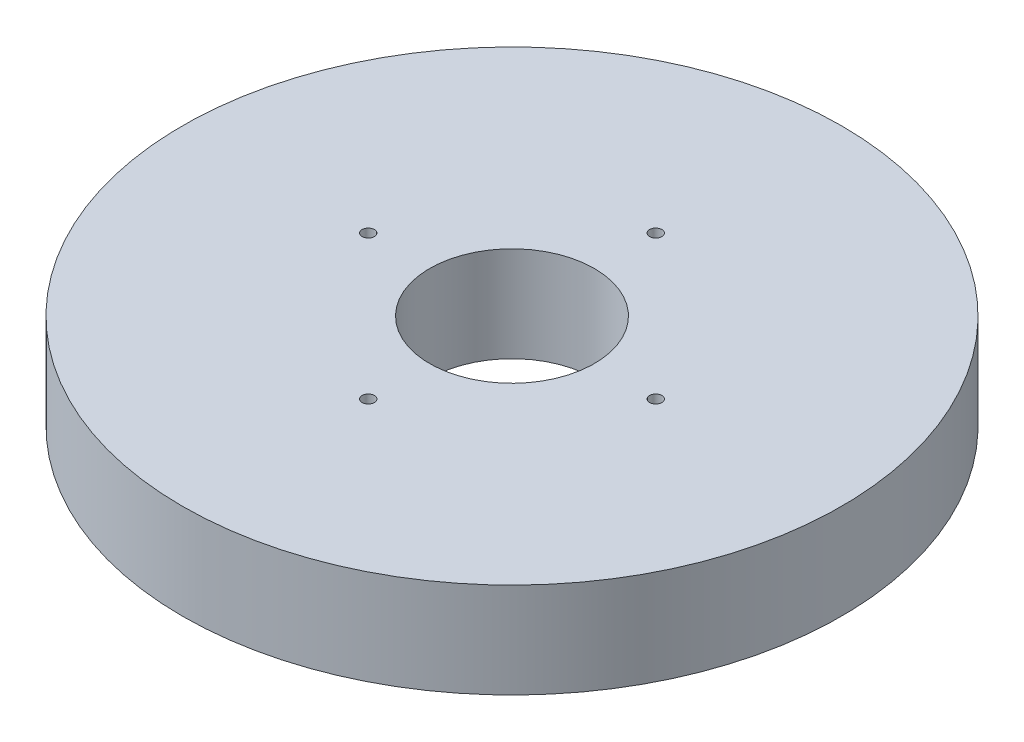
ISO-10303-21;
HEADER;
FILE_DESCRIPTION(('STEP AP214'),'2;1');
FILE_NAME('part.step','',(''),(''),'','','');
FILE_SCHEMA(('AUTOMOTIVE_DESIGN { 1 0 10303 214 1 1 1 1 }'));
ENDSEC;
DATA;
#1=APPLICATION_CONTEXT('core data for automotive mechanical design processes');
#2=APPLICATION_PROTOCOL_DEFINITION('international standard','automotive_design',2000,#1);
#3=PRODUCT_CONTEXT('',#1,'mechanical');
#4=PRODUCT('Part','Part','',(#3));
#5=PRODUCT_RELATED_PRODUCT_CATEGORY('part','',(#4));
#6=PRODUCT_DEFINITION_FORMATION('','',#4);
#7=PRODUCT_DEFINITION_CONTEXT('part definition',#1,'design');
#8=PRODUCT_DEFINITION('design','',#6,#7);
#9=PRODUCT_DEFINITION_SHAPE('','',#8);
#10=(LENGTH_UNIT() NAMED_UNIT(*) SI_UNIT(.MILLI.,.METRE.));
#11=(NAMED_UNIT(*) PLANE_ANGLE_UNIT() SI_UNIT($,.RADIAN.));
#12=(NAMED_UNIT(*) SI_UNIT($,.STERADIAN.) SOLID_ANGLE_UNIT());
#13=UNCERTAINTY_MEASURE_WITH_UNIT(LENGTH_MEASURE(1.E-05),#10,'distance_accuracy_value','');
#14=(GEOMETRIC_REPRESENTATION_CONTEXT(3) GLOBAL_UNCERTAINTY_ASSIGNED_CONTEXT((#13)) GLOBAL_UNIT_ASSIGNED_CONTEXT((#10,
#11,#12)) REPRESENTATION_CONTEXT('',''));
#15=CARTESIAN_POINT('',(0.,0.,0.));
#16=DIRECTION('',(0.,0.,1.));
#17=DIRECTION('',(1.,0.,0.));
#18=AXIS2_PLACEMENT_3D('',#15,#16,#17);
#19=CARTESIAN_POINT('',(0.,26.,0.));
#20=DIRECTION('',(0.,-1.,0.));
#21=DIRECTION('',(0.,0.,-1.));
#22=AXIS2_PLACEMENT_3D('',#19,#20,#21);
#23=CYLINDRICAL_SURFACE('',#22,90.);
#24=CARTESIAN_POINT('',(0.,26.,0.));
#25=DIRECTION('',(0.,1.,0.));
#26=DIRECTION('',(0.,0.,1.));
#27=AXIS2_PLACEMENT_3D('',#24,#25,#26);
#28=CIRCLE('',#27,90.);
#29=CARTESIAN_POINT('',(0.,26.,-90.));
#30=VERTEX_POINT('',#29);
#31=EDGE_CURVE('E10',#30,#30,#28,.T.);
#32=CARTESIAN_POINT('',(0.,0.,0.));
#33=DIRECTION('',(0.,1.,0.));
#34=DIRECTION('',(0.,0.,1.));
#35=AXIS2_PLACEMENT_3D('',#32,#33,#34);
#36=CIRCLE('',#35,90.);
#37=CARTESIAN_POINT('',(0.,0.,-90.));
#38=VERTEX_POINT('',#37);
#39=EDGE_CURVE('E37',#38,#38,#36,.T.);
#40=CARTESIAN_POINT('',(0.,26.,-90.));
#41=CARTESIAN_POINT('',(0.,25.7291666666667,-90.));
#42=CARTESIAN_POINT('',(0.,25.4583333333333,-90.));
#43=CARTESIAN_POINT('',(0.,24.9166666666667,-90.));
#44=CARTESIAN_POINT('',(0.,24.6458333333333,-90.));
#45=CARTESIAN_POINT('',(0.,24.1041666666667,-90.));
#46=CARTESIAN_POINT('',(0.,23.8333333333333,-90.));
#47=CARTESIAN_POINT('',(0.,23.2916666666667,-90.));
#48=CARTESIAN_POINT('',(0.,23.0208333333333,-90.));
#49=CARTESIAN_POINT('',(0.,22.4791666666667,-90.));
#50=CARTESIAN_POINT('',(0.,22.2083333333333,-90.));
#51=CARTESIAN_POINT('',(0.,21.6666666666667,-90.));
#52=CARTESIAN_POINT('',(0.,21.3958333333333,-90.));
#53=CARTESIAN_POINT('',(0.,20.8541666666667,-90.));
#54=CARTESIAN_POINT('',(0.,20.5833333333333,-90.));
#55=CARTESIAN_POINT('',(0.,20.0416666666667,-90.));
#56=CARTESIAN_POINT('',(0.,19.7708333333333,-90.));
#57=CARTESIAN_POINT('',(0.,19.2291666666667,-90.));
#58=CARTESIAN_POINT('',(0.,18.9583333333333,-90.));
#59=CARTESIAN_POINT('',(0.,18.4166666666667,-90.));
#60=CARTESIAN_POINT('',(0.,18.1458333333333,-90.));
#61=CARTESIAN_POINT('',(0.,17.6041666666667,-90.));
#62=CARTESIAN_POINT('',(0.,17.3333333333333,-90.));
#63=CARTESIAN_POINT('',(0.,16.7916666666667,-90.));
#64=CARTESIAN_POINT('',(0.,16.5208333333333,-90.));
#65=CARTESIAN_POINT('',(0.,15.9791666666667,-90.));
#66=CARTESIAN_POINT('',(0.,15.7083333333333,-90.));
#67=CARTESIAN_POINT('',(0.,15.1666666666667,-90.));
#68=CARTESIAN_POINT('',(0.,14.8958333333333,-90.));
#69=CARTESIAN_POINT('',(0.,14.3541666666667,-90.));
#70=CARTESIAN_POINT('',(0.,14.0833333333333,-90.));
#71=CARTESIAN_POINT('',(0.,13.5416666666667,-90.));
#72=CARTESIAN_POINT('',(0.,13.2708333333333,-90.));
#73=CARTESIAN_POINT('',(0.,12.7291666666667,-90.));
#74=CARTESIAN_POINT('',(0.,12.4583333333333,-90.));
#75=CARTESIAN_POINT('',(0.,11.9166666666667,-90.));
#76=CARTESIAN_POINT('',(0.,11.6458333333333,-90.));
#77=CARTESIAN_POINT('',(0.,11.1041666666667,-90.));
#78=CARTESIAN_POINT('',(0.,10.8333333333333,-90.));
#79=CARTESIAN_POINT('',(0.,10.2916666666667,-90.));
#80=CARTESIAN_POINT('',(0.,10.0208333333333,-90.));
#81=CARTESIAN_POINT('',(0.,9.47916666666667,-90.));
#82=CARTESIAN_POINT('',(0.,9.20833333333333,-90.));
#83=CARTESIAN_POINT('',(0.,8.66666666666667,-90.));
#84=CARTESIAN_POINT('',(0.,8.39583333333333,-90.));
#85=CARTESIAN_POINT('',(0.,7.85416666666667,-90.));
#86=CARTESIAN_POINT('',(0.,7.58333333333333,-90.));
#87=CARTESIAN_POINT('',(0.,7.04166666666667,-90.));
#88=CARTESIAN_POINT('',(0.,6.77083333333333,-90.));
#89=CARTESIAN_POINT('',(0.,6.22916666666667,-90.));
#90=CARTESIAN_POINT('',(0.,5.95833333333333,-90.));
#91=CARTESIAN_POINT('',(0.,5.41666666666667,-90.));
#92=CARTESIAN_POINT('',(0.,5.14583333333333,-90.));
#93=CARTESIAN_POINT('',(0.,4.60416666666667,-90.));
#94=CARTESIAN_POINT('',(0.,4.33333333333333,-90.));
#95=CARTESIAN_POINT('',(0.,3.79166666666667,-90.));
#96=CARTESIAN_POINT('',(0.,3.52083333333333,-90.));
#97=CARTESIAN_POINT('',(0.,2.97916666666667,-90.));
#98=CARTESIAN_POINT('',(0.,2.70833333333333,-90.));
#99=CARTESIAN_POINT('',(0.,2.16666666666667,-90.));
#100=CARTESIAN_POINT('',(0.,1.89583333333333,-90.));
#101=CARTESIAN_POINT('',(0.,1.35416666666667,-90.));
#102=CARTESIAN_POINT('',(0.,1.08333333333333,-90.));
#103=CARTESIAN_POINT('',(0.,0.541666666666667,-90.));
#104=CARTESIAN_POINT('',(0.,0.270833333333334,-90.));
#105=CARTESIAN_POINT('',(0.,0.,-90.));
#106=B_SPLINE_CURVE_WITH_KNOTS('',3,(#40,#41,#42,#43,#44,#45,#46,#47,#48,#49,#50,#51,#52,#53,
#54,#55,#56,#57,#58,#59,#60,#61,#62,#63,#64,#65,#66,#67,#68,#69,#70,#71,#72,#73,#74,#75,#76,#77,
#78,#79,#80,#81,#82,#83,#84,#85,#86,#87,#88,#89,#90,#91,#92,#93,#94,#95,#96,#97,#98,#99,#100,
#101,#102,#103,#104,#105),.UNSPECIFIED.,.F.,.F.,(4,2,2,2,2,2,2,2,2,2,2,2,2,2,2,2,2,2,2,2,2,2,2,
2,2,2,2,2,2,2,2,2,4),(0.,0.812500000000001,1.625,2.4375,3.25,4.0625,4.875,5.6875,6.5,7.3125,
8.125,8.9375,9.75,10.5625,11.375,12.1875,13.,13.8125,14.625,15.4375,16.25,17.0625,17.875,
18.6875,19.5,20.3125,21.125,21.9375,22.75,23.5625,24.375,25.1875,26.),.UNSPECIFIED.);
#107=EDGE_CURVE('BSEAM40',#30,#38,#106,.T.);
#108=ORIENTED_EDGE('',*,*,#31,.F.);
#109=ORIENTED_EDGE('',*,*,#39,.T.);
#110=ORIENTED_EDGE('',*,*,#107,.T.);
#111=ORIENTED_EDGE('',*,*,#107,.F.);
#112=EDGE_LOOP('',(#108,#110,#109,#111));
#113=FACE_BOUND('',#112,.T.);
#114=ADVANCED_FACE('F40',(#113),#23,.T.);
#115=CARTESIAN_POINT('',(0.,26.,0.));
#116=DIRECTION('',(0.,1.,0.));
#117=DIRECTION('',(0.,0.,1.));
#118=AXIS2_PLACEMENT_3D('',#115,#116,#117);
#119=PLANE('',#118);
#120=CARTESIAN_POINT('',(1.37045153029489E-13,26.,39.2512918527863));
#121=DIRECTION('',(0.,1.,0.));
#122=DIRECTION('',(1.,0.,0.));
#123=AXIS2_PLACEMENT_3D('',#120,#121,#122);
#124=CIRCLE('',#123,1.67783377994379);
#125=CARTESIAN_POINT('',(1.67783377994393,26.,39.2512918527863));
#126=VERTEX_POINT('',#125);
#127=EDGE_CURVE('E71',#126,#126,#124,.T.);
#128=ORIENTED_EDGE('',*,*,#127,.F.);
#129=EDGE_LOOP('',(#128));
#130=FACE_BOUND('',#129,.T.);
#131=CARTESIAN_POINT('',(39.2512918527863,26.,0.));
#132=DIRECTION('',(0.,1.,0.));
#133=DIRECTION('',(0.,0.,-1.));
#134=AXIS2_PLACEMENT_3D('',#131,#132,#133);
#135=CIRCLE('',#134,1.67783377994379);
#136=CARTESIAN_POINT('',(39.2512918527863,26.,-1.67783377994379));
#137=VERTEX_POINT('',#136);
#138=EDGE_CURVE('E70',#137,#137,#135,.T.);
#139=ORIENTED_EDGE('',*,*,#138,.F.);
#140=EDGE_LOOP('',(#139));
#141=FACE_BOUND('',#140,.T.);
#142=CARTESIAN_POINT('',(-4.11135459088467E-13,26.,-39.2512918527863));
#143=DIRECTION('',(0.,1.,0.));
#144=DIRECTION('',(-1.,0.,0.));
#145=AXIS2_PLACEMENT_3D('',#142,#143,#144);
#146=CIRCLE('',#145,1.67783377994379);
#147=CARTESIAN_POINT('',(-1.6778337799442,26.,-39.2512918527863));
#148=VERTEX_POINT('',#147);
#149=EDGE_CURVE('E61',#148,#148,#146,.T.);
#150=ORIENTED_EDGE('',*,*,#149,.F.);
#151=EDGE_LOOP('',(#150));
#152=FACE_BOUND('',#151,.T.);
#153=CARTESIAN_POINT('',(-39.2512918527863,26.,0.));
#154=DIRECTION('',(0.,1.,0.));
#155=DIRECTION('',(0.,0.,1.));
#156=AXIS2_PLACEMENT_3D('',#153,#154,#155);
#157=CIRCLE('',#156,1.67783377994379);
#158=CARTESIAN_POINT('',(-39.2512918527863,26.,1.67783377994379));
#159=VERTEX_POINT('',#158);
#160=EDGE_CURVE('E54',#159,#159,#157,.T.);
#161=ORIENTED_EDGE('',*,*,#160,.F.);
#162=EDGE_LOOP('',(#161));
#163=FACE_BOUND('',#162,.T.);
#164=CARTESIAN_POINT('',(0.,26.,0.));
#165=DIRECTION('',(0.,1.,0.));
#166=DIRECTION('',(0.,0.,1.));
#167=AXIS2_PLACEMENT_3D('',#164,#165,#166);
#168=CIRCLE('',#167,22.5);
#169=CARTESIAN_POINT('',(0.,26.,-22.5));
#170=VERTEX_POINT('',#169);
#171=EDGE_CURVE('E50',#170,#170,#168,.T.);
#172=ORIENTED_EDGE('',*,*,#171,.F.);
#173=EDGE_LOOP('',(#172));
#174=FACE_BOUND('',#173,.T.);
#175=ORIENTED_EDGE('',*,*,#31,.T.);
#176=EDGE_LOOP('',(#175));
#177=FACE_BOUND('',#176,.T.);
#178=ADVANCED_FACE('F86',(#130,#141,#152,#163,#174,#177),#119,.T.);
#179=CARTESIAN_POINT('',(0.,0.,0.));
#180=DIRECTION('',(0.,1.,0.));
#181=DIRECTION('',(0.,0.,1.));
#182=AXIS2_PLACEMENT_3D('',#179,#180,#181);
#183=PLANE('',#182);
#184=CARTESIAN_POINT('',(0.,0.,0.));
#185=DIRECTION('',(0.,1.,0.));
#186=DIRECTION('',(0.,0.,1.));
#187=AXIS2_PLACEMENT_3D('',#184,#185,#186);
#188=CIRCLE('',#187,22.5);
#189=CARTESIAN_POINT('',(0.,0.,-22.5));
#190=VERTEX_POINT('',#189);
#191=EDGE_CURVE('E47',#190,#190,#188,.T.);
#192=ORIENTED_EDGE('',*,*,#191,.T.);
#193=EDGE_LOOP('',(#192));
#194=FACE_BOUND('',#193,.T.);
#195=ORIENTED_EDGE('',*,*,#39,.F.);
#196=EDGE_LOOP('',(#195));
#197=FACE_BOUND('',#196,.T.);
#198=ADVANCED_FACE('F93',(#194,#197),#183,.F.);
#199=CARTESIAN_POINT('',(0.,26.,0.));
#200=DIRECTION('',(0.,-1.,0.));
#201=DIRECTION('',(0.,0.,-1.));
#202=AXIS2_PLACEMENT_3D('',#199,#200,#201);
#203=CYLINDRICAL_SURFACE('',#202,22.5);
#204=CARTESIAN_POINT('',(0.,26.,-22.5));
#205=CARTESIAN_POINT('',(0.,25.7291666666667,-22.5));
#206=CARTESIAN_POINT('',(0.,25.4583333333333,-22.5));
#207=CARTESIAN_POINT('',(0.,24.9166666666667,-22.5));
#208=CARTESIAN_POINT('',(0.,24.6458333333333,-22.5));
#209=CARTESIAN_POINT('',(0.,24.1041666666667,-22.5));
#210=CARTESIAN_POINT('',(0.,23.8333333333333,-22.5));
#211=CARTESIAN_POINT('',(0.,23.2916666666667,-22.5));
#212=CARTESIAN_POINT('',(0.,23.0208333333333,-22.5));
#213=CARTESIAN_POINT('',(0.,22.4791666666667,-22.5));
#214=CARTESIAN_POINT('',(0.,22.2083333333333,-22.5));
#215=CARTESIAN_POINT('',(0.,21.6666666666667,-22.5));
#216=CARTESIAN_POINT('',(0.,21.3958333333333,-22.5));
#217=CARTESIAN_POINT('',(0.,20.8541666666667,-22.5));
#218=CARTESIAN_POINT('',(0.,20.5833333333333,-22.5));
#219=CARTESIAN_POINT('',(0.,20.0416666666667,-22.5));
#220=CARTESIAN_POINT('',(0.,19.7708333333333,-22.5));
#221=CARTESIAN_POINT('',(0.,19.2291666666667,-22.5));
#222=CARTESIAN_POINT('',(0.,18.9583333333333,-22.5));
#223=CARTESIAN_POINT('',(0.,18.4166666666667,-22.5));
#224=CARTESIAN_POINT('',(0.,18.1458333333333,-22.5));
#225=CARTESIAN_POINT('',(0.,17.6041666666667,-22.5));
#226=CARTESIAN_POINT('',(0.,17.3333333333333,-22.5));
#227=CARTESIAN_POINT('',(0.,16.7916666666667,-22.5));
#228=CARTESIAN_POINT('',(0.,16.5208333333333,-22.5));
#229=CARTESIAN_POINT('',(0.,15.9791666666667,-22.5));
#230=CARTESIAN_POINT('',(0.,15.7083333333333,-22.5));
#231=CARTESIAN_POINT('',(0.,15.1666666666667,-22.5));
#232=CARTESIAN_POINT('',(0.,14.8958333333333,-22.5));
#233=CARTESIAN_POINT('',(0.,14.3541666666667,-22.5));
#234=CARTESIAN_POINT('',(0.,14.0833333333333,-22.5));
#235=CARTESIAN_POINT('',(0.,13.5416666666667,-22.5));
#236=CARTESIAN_POINT('',(0.,13.2708333333333,-22.5));
#237=CARTESIAN_POINT('',(0.,12.7291666666667,-22.5));
#238=CARTESIAN_POINT('',(0.,12.4583333333333,-22.5));
#239=CARTESIAN_POINT('',(0.,11.9166666666667,-22.5));
#240=CARTESIAN_POINT('',(0.,11.6458333333333,-22.5));
#241=CARTESIAN_POINT('',(0.,11.1041666666667,-22.5));
#242=CARTESIAN_POINT('',(0.,10.8333333333333,-22.5));
#243=CARTESIAN_POINT('',(0.,10.2916666666667,-22.5));
#244=CARTESIAN_POINT('',(0.,10.0208333333333,-22.5));
#245=CARTESIAN_POINT('',(0.,9.47916666666667,-22.5));
#246=CARTESIAN_POINT('',(0.,9.20833333333333,-22.5));
#247=CARTESIAN_POINT('',(0.,8.66666666666667,-22.5));
#248=CARTESIAN_POINT('',(0.,8.39583333333333,-22.5));
#249=CARTESIAN_POINT('',(0.,7.85416666666667,-22.5));
#250=CARTESIAN_POINT('',(0.,7.58333333333333,-22.5));
#251=CARTESIAN_POINT('',(0.,7.04166666666667,-22.5));
#252=CARTESIAN_POINT('',(0.,6.77083333333333,-22.5));
#253=CARTESIAN_POINT('',(0.,6.22916666666667,-22.5));
#254=CARTESIAN_POINT('',(0.,5.95833333333333,-22.5));
#255=CARTESIAN_POINT('',(0.,5.41666666666667,-22.5));
#256=CARTESIAN_POINT('',(0.,5.14583333333333,-22.5));
#257=CARTESIAN_POINT('',(0.,4.60416666666667,-22.5));
#258=CARTESIAN_POINT('',(0.,4.33333333333333,-22.5));
#259=CARTESIAN_POINT('',(0.,3.79166666666667,-22.5));
#260=CARTESIAN_POINT('',(0.,3.52083333333333,-22.5));
#261=CARTESIAN_POINT('',(0.,2.97916666666667,-22.5));
#262=CARTESIAN_POINT('',(0.,2.70833333333333,-22.5));
#263=CARTESIAN_POINT('',(0.,2.16666666666667,-22.5));
#264=CARTESIAN_POINT('',(0.,1.89583333333333,-22.5));
#265=CARTESIAN_POINT('',(0.,1.35416666666667,-22.5));
#266=CARTESIAN_POINT('',(0.,1.08333333333333,-22.5));
#267=CARTESIAN_POINT('',(0.,0.541666666666667,-22.5));
#268=CARTESIAN_POINT('',(0.,0.270833333333334,-22.5));
#269=CARTESIAN_POINT('',(0.,0.,-22.5));
#270=B_SPLINE_CURVE_WITH_KNOTS('',3,(#204,#205,#206,#207,#208,#209,#210,#211,#212,#213,#214,
#215,#216,#217,#218,#219,#220,#221,#222,#223,#224,#225,#226,#227,#228,#229,#230,#231,#232,#233,
#234,#235,#236,#237,#238,#239,#240,#241,#242,#243,#244,#245,#246,#247,#248,#249,#250,#251,#252,
#253,#254,#255,#256,#257,#258,#259,#260,#261,#262,#263,#264,#265,#266,#267,#268,#269),
.UNSPECIFIED.,.F.,.F.,(4,2,2,2,2,2,2,2,2,2,2,2,2,2,2,2,2,2,2,2,2,2,2,2,2,2,2,2,2,2,2,2,4),(0.,
0.812499999999997,1.625,2.4375,3.25,4.0625,4.875,5.6875,6.5,7.3125,8.125,8.93749999999999,
9.74999999999999,10.5625,11.375,12.1875,13.,13.8125,14.625,15.4375,16.25,17.0625,17.875,18.6875,
19.5,20.3125,21.125,21.9375,22.75,23.5625,24.375,25.1875,26.),.UNSPECIFIED.);
#271=EDGE_CURVE('BSEAM101',#170,#190,#270,.T.);
#272=ORIENTED_EDGE('',*,*,#171,.T.);
#273=ORIENTED_EDGE('',*,*,#191,.F.);
#274=ORIENTED_EDGE('',*,*,#271,.T.);
#275=ORIENTED_EDGE('',*,*,#271,.F.);
#276=EDGE_LOOP('',(#272,#274,#273,#275));
#277=FACE_BOUND('',#276,.T.);
#278=ADVANCED_FACE('F101',(#277),#203,.F.);
#279=CARTESIAN_POINT('',(-39.2512918527863,7.56450919576629,0.));
#280=DIRECTION('',(0.,1.,0.));
#281=DIRECTION('',(0.,0.,1.));
#282=AXIS2_PLACEMENT_3D('',#279,#280,#281);
#283=CYLINDRICAL_SURFACE('',#282,1.67783377994379);
#284=CARTESIAN_POINT('',(-39.2512918527863,7.56450919576629,0.));
#285=DIRECTION('',(0.,1.,0.));
#286=DIRECTION('',(0.,0.,1.));
#287=AXIS2_PLACEMENT_3D('',#284,#285,#286);
#288=CIRCLE('',#287,1.67783377994379);
#289=CARTESIAN_POINT('',(-39.2512918527863,7.56450919576629,1.67783377994379));
#290=VERTEX_POINT('',#289);
#291=EDGE_CURVE('E55',#290,#290,#288,.T.);
#292=ORIENTED_EDGE('',*,*,#291,.F.);
#293=EDGE_LOOP('',(#292));
#294=FACE_BOUND('',#293,.T.);
#295=ORIENTED_EDGE('',*,*,#160,.T.);
#296=EDGE_LOOP('',(#295));
#297=FACE_BOUND('',#296,.T.);
#298=ADVANCED_FACE('F102',(#294,#297),#283,.F.);
#299=CARTESIAN_POINT('',(-39.2512918527863,7.56450919576629,0.));
#300=DIRECTION('',(0.,1.,0.));
#301=DIRECTION('',(0.,0.,1.));
#302=AXIS2_PLACEMENT_3D('',#299,#300,#301);
#303=PLANE('',#302);
#304=ORIENTED_EDGE('',*,*,#291,.T.);
#305=EDGE_LOOP('',(#304));
#306=FACE_BOUND('',#305,.T.);
#307=ADVANCED_FACE('F133',(#306),#303,.T.);
#308=CARTESIAN_POINT('',(-4.11135459088467E-13,7.56450919576629,-39.2512918527863));
#309=DIRECTION('',(0.,1.,0.));
#310=DIRECTION('',(0.,0.,1.));
#311=AXIS2_PLACEMENT_3D('',#308,#309,#310);
#312=CYLINDRICAL_SURFACE('',#311,1.67783377994379);
#313=CARTESIAN_POINT('',(-4.11135459088467E-13,7.56450919576629,-39.2512918527863));
#314=DIRECTION('',(0.,1.,0.));
#315=DIRECTION('',(-1.,0.,0.));
#316=AXIS2_PLACEMENT_3D('',#313,#314,#315);
#317=CIRCLE('',#316,1.67783377994379);
#318=CARTESIAN_POINT('',(-1.6778337799442,7.56450919576629,-39.2512918527863));
#319=VERTEX_POINT('',#318);
#320=EDGE_CURVE('E63',#319,#319,#317,.T.);
#321=ORIENTED_EDGE('',*,*,#320,.F.);
#322=EDGE_LOOP('',(#321));
#323=FACE_BOUND('',#322,.T.);
#324=ORIENTED_EDGE('',*,*,#149,.T.);
#325=EDGE_LOOP('',(#324));
#326=FACE_BOUND('',#325,.T.);
#327=ADVANCED_FACE('F142',(#323,#326),#312,.F.);
#328=CARTESIAN_POINT('',(-4.11135459088467E-13,7.56450919576629,-39.2512918527863));
#329=DIRECTION('',(0.,1.,0.));
#330=DIRECTION('',(-1.,0.,0.));
#331=AXIS2_PLACEMENT_3D('',#328,#329,#330);
#332=PLANE('',#331);
#333=ORIENTED_EDGE('',*,*,#320,.T.);
#334=EDGE_LOOP('',(#333));
#335=FACE_BOUND('',#334,.T.);
#336=ADVANCED_FACE('F156',(#335),#332,.T.);
#337=CARTESIAN_POINT('',(39.2512918527863,7.56450919576629,0.));
#338=DIRECTION('',(0.,1.,0.));
#339=DIRECTION('',(0.,0.,1.));
#340=AXIS2_PLACEMENT_3D('',#337,#338,#339);
#341=CYLINDRICAL_SURFACE('',#340,1.67783377994379);
#342=CARTESIAN_POINT('',(39.2512918527863,7.56450919576629,0.));
#343=DIRECTION('',(0.,1.,0.));
#344=DIRECTION('',(0.,0.,-1.));
#345=AXIS2_PLACEMENT_3D('',#342,#343,#344);
#346=CIRCLE('',#345,1.67783377994379);
#347=CARTESIAN_POINT('',(39.2512918527863,7.56450919576629,-1.67783377994379));
#348=VERTEX_POINT('',#347);
#349=EDGE_CURVE('E69',#348,#348,#346,.T.);
#350=ORIENTED_EDGE('',*,*,#349,.F.);
#351=EDGE_LOOP('',(#350));
#352=FACE_BOUND('',#351,.T.);
#353=ORIENTED_EDGE('',*,*,#138,.T.);
#354=EDGE_LOOP('',(#353));
#355=FACE_BOUND('',#354,.T.);
#356=ADVANCED_FACE('F164',(#352,#355),#341,.F.);
#357=CARTESIAN_POINT('',(39.2512918527863,7.56450919576629,0.));
#358=DIRECTION('',(0.,1.,0.));
#359=DIRECTION('',(0.,0.,-1.));
#360=AXIS2_PLACEMENT_3D('',#357,#358,#359);
#361=PLANE('',#360);
#362=ORIENTED_EDGE('',*,*,#349,.T.);
#363=EDGE_LOOP('',(#362));
#364=FACE_BOUND('',#363,.T.);
#365=ADVANCED_FACE('F83',(#364),#361,.T.);
#366=CARTESIAN_POINT('',(1.37045153029489E-13,7.56450919576629,39.2512918527863));
#367=DIRECTION('',(0.,1.,0.));
#368=DIRECTION('',(0.,0.,1.));
#369=AXIS2_PLACEMENT_3D('',#366,#367,#368);
#370=CYLINDRICAL_SURFACE('',#369,1.67783377994379);
#371=CARTESIAN_POINT('',(1.37045153029489E-13,7.56450919576629,39.2512918527863));
#372=DIRECTION('',(0.,1.,0.));
#373=DIRECTION('',(1.,0.,0.));
#374=AXIS2_PLACEMENT_3D('',#371,#372,#373);
#375=CIRCLE('',#374,1.67783377994379);
#376=CARTESIAN_POINT('',(1.67783377994393,7.56450919576629,39.2512918527863));
#377=VERTEX_POINT('',#376);
#378=EDGE_CURVE('E59',#377,#377,#375,.T.);
#379=ORIENTED_EDGE('',*,*,#378,.F.);
#380=EDGE_LOOP('',(#379));
#381=FACE_BOUND('',#380,.T.);
#382=ORIENTED_EDGE('',*,*,#127,.T.);
#383=EDGE_LOOP('',(#382));
#384=FACE_BOUND('',#383,.T.);
#385=ADVANCED_FACE('F81',(#381,#384),#370,.F.);
#386=CARTESIAN_POINT('',(1.37045153029489E-13,7.56450919576629,39.2512918527863));
#387=DIRECTION('',(0.,1.,0.));
#388=DIRECTION('',(1.,0.,0.));
#389=AXIS2_PLACEMENT_3D('',#386,#387,#388);
#390=PLANE('',#389);
#391=ORIENTED_EDGE('',*,*,#378,.T.);
#392=EDGE_LOOP('',(#391));
#393=FACE_BOUND('',#392,.T.);
#394=ADVANCED_FACE('F78',(#393),#390,.T.);
#395=CLOSED_SHELL('',(#114,#178,#198,#278,#298,#307,#327,#336,#356,#365,#385,#394));
#396=MANIFOLD_SOLID_BREP('B2',#395);
#397=ADVANCED_BREP_SHAPE_REPRESENTATION('',(#18,#396),#14);
#398=SHAPE_DEFINITION_REPRESENTATION(#9,#397);
ENDSEC;
END-ISO-10303-21;
